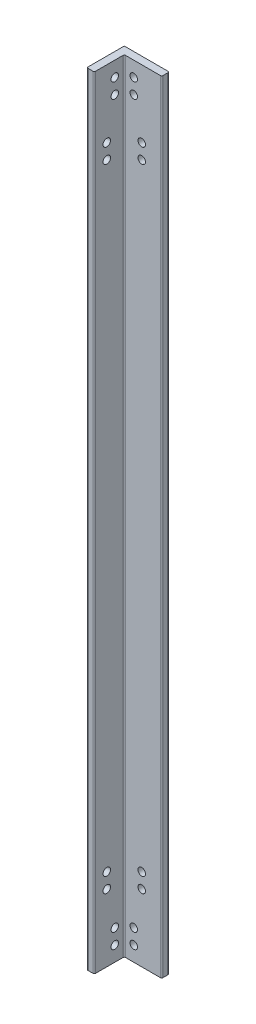
ISO-10303-21;
HEADER;
FILE_DESCRIPTION(('STEP AP214'),'2;1');
FILE_NAME('part.step','',(''),(''),'','','');
FILE_SCHEMA(('AUTOMOTIVE_DESIGN { 1 0 10303 214 1 1 1 1 }'));
ENDSEC;
DATA;
#1=APPLICATION_CONTEXT('core data for automotive mechanical design processes');
#2=APPLICATION_PROTOCOL_DEFINITION('international standard','automotive_design',2000,#1);
#3=PRODUCT_CONTEXT('',#1,'mechanical');
#4=PRODUCT('Part','Part','',(#3));
#5=PRODUCT_RELATED_PRODUCT_CATEGORY('part','',(#4));
#6=PRODUCT_DEFINITION_FORMATION('','',#4);
#7=PRODUCT_DEFINITION_CONTEXT('part definition',#1,'design');
#8=PRODUCT_DEFINITION('design','',#6,#7);
#9=PRODUCT_DEFINITION_SHAPE('','',#8);
#10=(LENGTH_UNIT() NAMED_UNIT(*) SI_UNIT(.MILLI.,.METRE.));
#11=(NAMED_UNIT(*) PLANE_ANGLE_UNIT() SI_UNIT($,.RADIAN.));
#12=(NAMED_UNIT(*) SI_UNIT($,.STERADIAN.) SOLID_ANGLE_UNIT());
#13=UNCERTAINTY_MEASURE_WITH_UNIT(LENGTH_MEASURE(1.E-05),#10,'distance_accuracy_value','');
#14=(GEOMETRIC_REPRESENTATION_CONTEXT(3) GLOBAL_UNCERTAINTY_ASSIGNED_CONTEXT((#13)) GLOBAL_UNIT_ASSIGNED_CONTEXT((#10,
#11,#12)) REPRESENTATION_CONTEXT('',''));
#15=CARTESIAN_POINT('',(0.,0.,0.));
#16=DIRECTION('',(0.,0.,1.));
#17=DIRECTION('',(1.,0.,0.));
#18=AXIS2_PLACEMENT_3D('',#15,#16,#17);
#19=CARTESIAN_POINT('',(0.,-293.642857142857,3.));
#20=DIRECTION('',(0.,-1.,0.));
#21=DIRECTION('',(0.,0.,-1.));
#22=AXIS2_PLACEMENT_3D('',#19,#20,#21);
#23=PLANE('',#22);
#24=DIRECTION('',(-1.,0.,0.));
#25=VECTOR('',#24,1.);
#26=CARTESIAN_POINT('',(0.,-293.642857142857,0.));
#27=LINE('',#26,#25);
#28=CARTESIAN_POINT('',(14.8428571428572,-293.642857142857,0.));
#29=VERTEX_POINT('',#28);
#30=CARTESIAN_POINT('',(-2.65714285714283,-293.642857142857,0.));
#31=VERTEX_POINT('',#30);
#32=EDGE_CURVE('E140',#29,#31,#27,.T.);
#33=ORIENTED_EDGE('',*,*,#32,.F.);
#34=CARTESIAN_POINT('',(14.8428571428572,-293.642857142857,0.5));
#35=DIRECTION('',(0.,-1.,0.));
#36=DIRECTION('',(0.,0.,-1.));
#37=AXIS2_PLACEMENT_3D('',#34,#35,#36);
#38=CIRCLE('',#37,0.5);
#39=CARTESIAN_POINT('',(15.3428571428572,-293.642857142857,0.5));
#40=VERTEX_POINT('',#39);
#41=EDGE_CURVE('E227',#29,#40,#38,.T.);
#42=ORIENTED_EDGE('',*,*,#41,.T.);
#43=DIRECTION('',(0.,0.,-1.));
#44=VECTOR('',#43,1.);
#45=CARTESIAN_POINT('',(15.3428571428572,-293.642857142857,3.));
#46=LINE('',#45,#44);
#47=CARTESIAN_POINT('',(15.3428571428572,-293.642857142857,2.5));
#48=VERTEX_POINT('',#47);
#49=EDGE_CURVE('E216',#48,#40,#46,.T.);
#50=ORIENTED_EDGE('',*,*,#49,.F.);
#51=CARTESIAN_POINT('',(14.8428571428572,-293.642857142857,2.5));
#52=DIRECTION('',(0.,-1.,0.));
#53=DIRECTION('',(0.,0.,-1.));
#54=AXIS2_PLACEMENT_3D('',#51,#52,#53);
#55=CIRCLE('',#54,0.5);
#56=CARTESIAN_POINT('',(14.8428571428572,-293.642857142857,3.));
#57=VERTEX_POINT('',#56);
#58=EDGE_CURVE('E225',#48,#57,#55,.T.);
#59=ORIENTED_EDGE('',*,*,#58,.T.);
#60=DIRECTION('',(-1.,0.,0.));
#61=VECTOR('',#60,1.);
#62=CARTESIAN_POINT('',(0.,-293.642857142857,3.));
#63=LINE('',#62,#61);
#64=CARTESIAN_POINT('',(0.842857142857173,-293.642857142857,3.));
#65=VERTEX_POINT('',#64);
#66=EDGE_CURVE('E185',#57,#65,#63,.T.);
#67=ORIENTED_EDGE('',*,*,#66,.T.);
#68=CARTESIAN_POINT('',(0.842857142857173,-293.642857142857,3.5));
#69=DIRECTION('',(0.,-1.,0.));
#70=DIRECTION('',(0.,0.,-1.));
#71=AXIS2_PLACEMENT_3D('',#68,#69,#70);
#72=CIRCLE('',#71,0.5);
#73=CARTESIAN_POINT('',(0.342857142857173,-293.642857142857,3.5));
#74=VERTEX_POINT('',#73);
#75=EDGE_CURVE('E11',#65,#74,#72,.F.);
#76=ORIENTED_EDGE('',*,*,#75,.T.);
#77=DIRECTION('',(0.,0.,-1.));
#78=VECTOR('',#77,1.);
#79=CARTESIAN_POINT('',(0.342857142857173,-293.642857142857,15.));
#80=LINE('',#79,#78);
#81=CARTESIAN_POINT('',(0.342857142857173,-293.642857142857,14.5));
#82=VERTEX_POINT('',#81);
#83=EDGE_CURVE('E156',#82,#74,#80,.T.);
#84=ORIENTED_EDGE('',*,*,#83,.F.);
#85=CARTESIAN_POINT('',(-0.157142857142827,-293.642857142857,14.5));
#86=DIRECTION('',(0.,-1.,0.));
#87=DIRECTION('',(0.,0.,-1.));
#88=AXIS2_PLACEMENT_3D('',#85,#86,#87);
#89=CIRCLE('',#88,0.5);
#90=CARTESIAN_POINT('',(-0.157142857142827,-293.642857142857,15.));
#91=VERTEX_POINT('',#90);
#92=EDGE_CURVE('E221',#82,#91,#89,.T.);
#93=ORIENTED_EDGE('',*,*,#92,.T.);
#94=DIRECTION('',(1.,0.,0.));
#95=VECTOR('',#94,1.);
#96=CARTESIAN_POINT('',(0.,-293.642857142857,15.));
#97=LINE('',#96,#95);
#98=CARTESIAN_POINT('',(-2.15714285714283,-293.642857142857,15.));
#99=VERTEX_POINT('',#98);
#100=EDGE_CURVE('E149',#99,#91,#97,.T.);
#101=ORIENTED_EDGE('',*,*,#100,.F.);
#102=CARTESIAN_POINT('',(-2.15714285714283,-293.642857142857,14.5));
#103=DIRECTION('',(0.,-1.,0.));
#104=DIRECTION('',(0.,0.,-1.));
#105=AXIS2_PLACEMENT_3D('',#102,#103,#104);
#106=CIRCLE('',#105,0.5);
#107=CARTESIAN_POINT('',(-2.65714285714283,-293.642857142857,14.5));
#108=VERTEX_POINT('',#107);
#109=EDGE_CURVE('E223',#99,#108,#106,.T.);
#110=ORIENTED_EDGE('',*,*,#109,.T.);
#111=DIRECTION('',(0.,0.,-1.));
#112=VECTOR('',#111,1.);
#113=CARTESIAN_POINT('',(-2.65714285714283,-293.642857142857,15.));
#114=LINE('',#113,#112);
#115=EDGE_CURVE('E128',#108,#31,#114,.T.);
#116=ORIENTED_EDGE('',*,*,#115,.T.);
#117=EDGE_LOOP('',(#33,#42,#50,#59,#67,#76,#84,#93,#101,#110,#116));
#118=FACE_BOUND('',#117,.T.);
#119=ADVANCED_FACE('F36',(#118),#23,.T.);
#120=CARTESIAN_POINT('',(15.3428571428571,0.,3.));
#121=DIRECTION('',(1.,0.,0.));
#122=DIRECTION('',(0.,1.,0.));
#123=AXIS2_PLACEMENT_3D('',#120,#121,#122);
#124=PLANE('',#123);
#125=ORIENTED_EDGE('',*,*,#49,.T.);
#126=DIRECTION('',(0.,-1.,0.));
#127=VECTOR('',#126,1.);
#128=CARTESIAN_POINT('',(15.3428571428571,19.3571428571429,0.5));
#129=LINE('',#128,#127);
#130=CARTESIAN_POINT('',(15.3428571428571,19.3571428571429,0.5));
#131=VERTEX_POINT('',#130);
#132=EDGE_CURVE('E232',#40,#131,#129,.F.);
#133=ORIENTED_EDGE('',*,*,#132,.T.);
#134=DIRECTION('',(0.,0.,-1.));
#135=VECTOR('',#134,1.);
#136=CARTESIAN_POINT('',(15.3428571428571,19.3571428571429,3.));
#137=LINE('',#136,#135);
#138=CARTESIAN_POINT('',(15.3428571428571,19.3571428571429,2.5));
#139=VERTEX_POINT('',#138);
#140=EDGE_CURVE('E190',#139,#131,#137,.T.);
#141=ORIENTED_EDGE('',*,*,#140,.F.);
#142=DIRECTION('',(0.,-1.,0.));
#143=VECTOR('',#142,1.);
#144=CARTESIAN_POINT('',(15.3428571428571,0.,2.5));
#145=LINE('',#144,#143);
#146=EDGE_CURVE('E229',#139,#48,#145,.T.);
#147=ORIENTED_EDGE('',*,*,#146,.T.);
#148=EDGE_LOOP('',(#125,#133,#141,#147));
#149=FACE_BOUND('',#148,.T.);
#150=ADVANCED_FACE('F279',(#149),#124,.T.);
#151=CARTESIAN_POINT('',(0.,19.3571428571429,3.));
#152=DIRECTION('',(0.,1.,0.));
#153=DIRECTION('',(0.,0.,1.));
#154=AXIS2_PLACEMENT_3D('',#151,#152,#153);
#155=PLANE('',#154);
#156=ORIENTED_EDGE('',*,*,#140,.T.);
#157=CARTESIAN_POINT('',(14.8428571428571,19.3571428571429,0.5));
#158=DIRECTION('',(0.,1.,0.));
#159=DIRECTION('',(0.,0.,1.));
#160=AXIS2_PLACEMENT_3D('',#157,#158,#159);
#161=CIRCLE('',#160,0.5);
#162=CARTESIAN_POINT('',(14.8428571428571,19.3571428571429,0.));
#163=VERTEX_POINT('',#162);
#164=EDGE_CURVE('E135',#131,#163,#161,.T.);
#165=ORIENTED_EDGE('',*,*,#164,.T.);
#166=DIRECTION('',(1.,0.,0.));
#167=VECTOR('',#166,1.);
#168=CARTESIAN_POINT('',(0.,19.3571428571429,0.));
#169=LINE('',#168,#167);
#170=CARTESIAN_POINT('',(-2.6571428571429,19.3571428571429,0.));
#171=VERTEX_POINT('',#170);
#172=EDGE_CURVE('E131',#171,#163,#169,.T.);
#173=ORIENTED_EDGE('',*,*,#172,.F.);
#174=DIRECTION('',(0.,0.,-1.));
#175=VECTOR('',#174,1.);
#176=CARTESIAN_POINT('',(-2.6571428571429,19.3571428571429,15.));
#177=LINE('',#176,#175);
#178=CARTESIAN_POINT('',(-2.6571428571429,19.3571428571429,14.5));
#179=VERTEX_POINT('',#178);
#180=EDGE_CURVE('E118',#179,#171,#177,.T.);
#181=ORIENTED_EDGE('',*,*,#180,.F.);
#182=CARTESIAN_POINT('',(-2.1571428571429,19.3571428571429,14.5));
#183=DIRECTION('',(0.,1.,0.));
#184=DIRECTION('',(0.,0.,1.));
#185=AXIS2_PLACEMENT_3D('',#182,#183,#184);
#186=CIRCLE('',#185,0.5);
#187=CARTESIAN_POINT('',(-2.1571428571429,19.3571428571429,15.));
#188=VERTEX_POINT('',#187);
#189=EDGE_CURVE('E236',#179,#188,#186,.T.);
#190=ORIENTED_EDGE('',*,*,#189,.T.);
#191=DIRECTION('',(-1.,0.,0.));
#192=VECTOR('',#191,1.);
#193=CARTESIAN_POINT('',(0.,19.3571428571429,15.));
#194=LINE('',#193,#192);
#195=CARTESIAN_POINT('',(-0.157142857142903,19.3571428571429,15.));
#196=VERTEX_POINT('',#195);
#197=EDGE_CURVE('E145',#196,#188,#194,.T.);
#198=ORIENTED_EDGE('',*,*,#197,.F.);
#199=CARTESIAN_POINT('',(-0.157142857142903,19.3571428571429,14.5));
#200=DIRECTION('',(0.,1.,0.));
#201=DIRECTION('',(0.,0.,1.));
#202=AXIS2_PLACEMENT_3D('',#199,#200,#201);
#203=CIRCLE('',#202,0.5);
#204=CARTESIAN_POINT('',(0.342857142857097,19.3571428571429,14.5));
#205=VERTEX_POINT('',#204);
#206=EDGE_CURVE('E234',#196,#205,#203,.T.);
#207=ORIENTED_EDGE('',*,*,#206,.T.);
#208=DIRECTION('',(0.,0.,-1.));
#209=VECTOR('',#208,1.);
#210=CARTESIAN_POINT('',(0.342857142857097,19.3571428571429,15.));
#211=LINE('',#210,#209);
#212=CARTESIAN_POINT('',(0.342857142857097,19.3571428571429,3.5));
#213=VERTEX_POINT('',#212);
#214=EDGE_CURVE('E127',#205,#213,#211,.T.);
#215=ORIENTED_EDGE('',*,*,#214,.T.);
#216=CARTESIAN_POINT('',(0.842857142857097,19.3571428571429,3.5));
#217=DIRECTION('',(0.,1.,0.));
#218=DIRECTION('',(0.,0.,1.));
#219=AXIS2_PLACEMENT_3D('',#216,#217,#218);
#220=CIRCLE('',#219,0.5);
#221=CARTESIAN_POINT('',(0.842857142857097,19.3571428571429,3.));
#222=VERTEX_POINT('',#221);
#223=EDGE_CURVE('E44',#213,#222,#220,.F.);
#224=ORIENTED_EDGE('',*,*,#223,.T.);
#225=DIRECTION('',(1.,0.,0.));
#226=VECTOR('',#225,1.);
#227=CARTESIAN_POINT('',(0.,19.3571428571429,3.));
#228=LINE('',#227,#226);
#229=CARTESIAN_POINT('',(14.8428571428571,19.3571428571429,3.));
#230=VERTEX_POINT('',#229);
#231=EDGE_CURVE('E188',#222,#230,#228,.T.);
#232=ORIENTED_EDGE('',*,*,#231,.T.);
#233=CARTESIAN_POINT('',(14.8428571428571,19.3571428571429,2.5));
#234=DIRECTION('',(0.,1.,0.));
#235=DIRECTION('',(0.,0.,1.));
#236=AXIS2_PLACEMENT_3D('',#233,#234,#235);
#237=CIRCLE('',#236,0.5);
#238=EDGE_CURVE('E238',#230,#139,#237,.T.);
#239=ORIENTED_EDGE('',*,*,#238,.T.);
#240=EDGE_LOOP('',(#156,#165,#173,#181,#190,#198,#207,#215,#224,#232,#239));
#241=FACE_BOUND('',#240,.T.);
#242=ADVANCED_FACE('F133',(#241),#155,.T.);
#243=CARTESIAN_POINT('',(4.1428571428571,13.3571428571429,3.));
#244=DIRECTION('',(0.,0.,-1.));
#245=DIRECTION('',(-1.,0.,0.));
#246=AXIS2_PLACEMENT_3D('',#243,#244,#245);
#247=CYLINDRICAL_SURFACE('',#246,1.5);
#248=CARTESIAN_POINT('',(4.1428571428571,13.3571428571429,3.));
#249=DIRECTION('',(0.,0.,1.));
#250=DIRECTION('',(1.,0.,0.));
#251=AXIS2_PLACEMENT_3D('',#248,#249,#250);
#252=CIRCLE('',#251,1.5);
#253=CARTESIAN_POINT('',(5.6428571428571,13.3571428571429,3.));
#254=VERTEX_POINT('',#253);
#255=EDGE_CURVE('E182',#254,#254,#252,.T.);
#256=ORIENTED_EDGE('',*,*,#255,.T.);
#257=EDGE_LOOP('',(#256));
#258=FACE_BOUND('',#257,.T.);
#259=CARTESIAN_POINT('',(4.1428571428571,13.3571428571429,0.));
#260=DIRECTION('',(0.,0.,1.));
#261=DIRECTION('',(1.,0.,0.));
#262=AXIS2_PLACEMENT_3D('',#259,#260,#261);
#263=CIRCLE('',#262,1.5);
#264=CARTESIAN_POINT('',(5.6428571428571,13.3571428571429,0.));
#265=VERTEX_POINT('',#264);
#266=EDGE_CURVE('E211',#265,#265,#263,.T.);
#267=ORIENTED_EDGE('',*,*,#266,.F.);
#268=EDGE_LOOP('',(#267));
#269=FACE_BOUND('',#268,.T.);
#270=ADVANCED_FACE('F305',(#258,#269),#247,.F.);
#271=CARTESIAN_POINT('',(4.14285714285713,-287.642857142857,3.));
#272=DIRECTION('',(0.,0.,-1.));
#273=DIRECTION('',(-1.,0.,0.));
#274=AXIS2_PLACEMENT_3D('',#271,#272,#273);
#275=CYLINDRICAL_SURFACE('',#274,1.5);
#276=CARTESIAN_POINT('',(4.14285714285713,-287.642857142857,3.));
#277=DIRECTION('',(0.,0.,1.));
#278=DIRECTION('',(1.,0.,0.));
#279=AXIS2_PLACEMENT_3D('',#276,#277,#278);
#280=CIRCLE('',#279,1.5);
#281=CARTESIAN_POINT('',(5.64285714285714,-287.642857142857,3.));
#282=VERTEX_POINT('',#281);
#283=EDGE_CURVE('E179',#282,#282,#280,.T.);
#284=ORIENTED_EDGE('',*,*,#283,.T.);
#285=EDGE_LOOP('',(#284));
#286=FACE_BOUND('',#285,.T.);
#287=CARTESIAN_POINT('',(4.14285714285713,-287.642857142857,0.));
#288=DIRECTION('',(0.,0.,1.));
#289=DIRECTION('',(1.,0.,0.));
#290=AXIS2_PLACEMENT_3D('',#287,#288,#289);
#291=CIRCLE('',#290,1.5);
#292=CARTESIAN_POINT('',(5.64285714285714,-287.642857142857,0.));
#293=VERTEX_POINT('',#292);
#294=EDGE_CURVE('E208',#293,#293,#291,.T.);
#295=ORIENTED_EDGE('',*,*,#294,.F.);
#296=EDGE_LOOP('',(#295));
#297=FACE_BOUND('',#296,.T.);
#298=ADVANCED_FACE('F308',(#286,#297),#275,.F.);
#299=CARTESIAN_POINT('',(4.1428571428571,7.35714285714287,3.));
#300=DIRECTION('',(0.,0.,-1.));
#301=DIRECTION('',(-1.,0.,0.));
#302=AXIS2_PLACEMENT_3D('',#299,#300,#301);
#303=CYLINDRICAL_SURFACE('',#302,1.5);
#304=CARTESIAN_POINT('',(4.1428571428571,7.35714285714287,3.));
#305=DIRECTION('',(0.,0.,1.));
#306=DIRECTION('',(1.,0.,0.));
#307=AXIS2_PLACEMENT_3D('',#304,#305,#306);
#308=CIRCLE('',#307,1.5);
#309=CARTESIAN_POINT('',(5.6428571428571,7.35714285714287,3.));
#310=VERTEX_POINT('',#309);
#311=EDGE_CURVE('E176',#310,#310,#308,.T.);
#312=ORIENTED_EDGE('',*,*,#311,.T.);
#313=EDGE_LOOP('',(#312));
#314=FACE_BOUND('',#313,.T.);
#315=CARTESIAN_POINT('',(4.1428571428571,7.35714285714287,0.));
#316=DIRECTION('',(0.,0.,1.));
#317=DIRECTION('',(1.,0.,0.));
#318=AXIS2_PLACEMENT_3D('',#315,#316,#317);
#319=CIRCLE('',#318,1.5);
#320=CARTESIAN_POINT('',(5.6428571428571,7.35714285714287,0.));
#321=VERTEX_POINT('',#320);
#322=EDGE_CURVE('E205',#321,#321,#319,.T.);
#323=ORIENTED_EDGE('',*,*,#322,.F.);
#324=EDGE_LOOP('',(#323));
#325=FACE_BOUND('',#324,.T.);
#326=ADVANCED_FACE('F312',(#314,#325),#303,.F.);
#327=CARTESIAN_POINT('',(4.14285714285713,-281.642857142857,3.));
#328=DIRECTION('',(0.,0.,-1.));
#329=DIRECTION('',(-1.,0.,0.));
#330=AXIS2_PLACEMENT_3D('',#327,#328,#329);
#331=CYLINDRICAL_SURFACE('',#330,1.5);
#332=CARTESIAN_POINT('',(4.14285714285713,-281.642857142857,3.));
#333=DIRECTION('',(0.,0.,1.));
#334=DIRECTION('',(1.,0.,0.));
#335=AXIS2_PLACEMENT_3D('',#332,#333,#334);
#336=CIRCLE('',#335,1.5);
#337=CARTESIAN_POINT('',(5.64285714285714,-281.642857142857,3.));
#338=VERTEX_POINT('',#337);
#339=EDGE_CURVE('E173',#338,#338,#336,.T.);
#340=ORIENTED_EDGE('',*,*,#339,.T.);
#341=EDGE_LOOP('',(#340));
#342=FACE_BOUND('',#341,.T.);
#343=CARTESIAN_POINT('',(4.14285714285713,-281.642857142857,0.));
#344=DIRECTION('',(0.,0.,1.));
#345=DIRECTION('',(1.,0.,0.));
#346=AXIS2_PLACEMENT_3D('',#343,#344,#345);
#347=CIRCLE('',#346,1.5);
#348=CARTESIAN_POINT('',(5.64285714285714,-281.642857142857,0.));
#349=VERTEX_POINT('',#348);
#350=EDGE_CURVE('E202',#349,#349,#347,.T.);
#351=ORIENTED_EDGE('',*,*,#350,.F.);
#352=EDGE_LOOP('',(#351));
#353=FACE_BOUND('',#352,.T.);
#354=ADVANCED_FACE('F316',(#342,#353),#331,.F.);
#355=CARTESIAN_POINT('',(7.34285714285717,-266.642857142857,3.));
#356=DIRECTION('',(0.,0.,-1.));
#357=DIRECTION('',(-1.,0.,0.));
#358=AXIS2_PLACEMENT_3D('',#355,#356,#357);
#359=CYLINDRICAL_SURFACE('',#358,1.5);
#360=CARTESIAN_POINT('',(7.34285714285717,-266.642857142857,3.));
#361=DIRECTION('',(0.,0.,1.));
#362=DIRECTION('',(1.,0.,0.));
#363=AXIS2_PLACEMENT_3D('',#360,#361,#362);
#364=CIRCLE('',#363,1.5);
#365=CARTESIAN_POINT('',(8.84285714285717,-266.642857142857,3.));
#366=VERTEX_POINT('',#365);
#367=EDGE_CURVE('E170',#366,#366,#364,.T.);
#368=ORIENTED_EDGE('',*,*,#367,.T.);
#369=EDGE_LOOP('',(#368));
#370=FACE_BOUND('',#369,.T.);
#371=CARTESIAN_POINT('',(7.34285714285717,-266.642857142857,0.));
#372=DIRECTION('',(0.,0.,1.));
#373=DIRECTION('',(1.,0.,0.));
#374=AXIS2_PLACEMENT_3D('',#371,#372,#373);
#375=CIRCLE('',#374,1.5);
#376=CARTESIAN_POINT('',(8.84285714285717,-266.642857142857,0.));
#377=VERTEX_POINT('',#376);
#378=EDGE_CURVE('E199',#377,#377,#375,.T.);
#379=ORIENTED_EDGE('',*,*,#378,.F.);
#380=EDGE_LOOP('',(#379));
#381=FACE_BOUND('',#380,.T.);
#382=ADVANCED_FACE('F320',(#370,#381),#359,.F.);
#383=CARTESIAN_POINT('',(7.34285714285717,-260.642857142857,3.));
#384=DIRECTION('',(0.,0.,-1.));
#385=DIRECTION('',(-1.,0.,0.));
#386=AXIS2_PLACEMENT_3D('',#383,#384,#385);
#387=CYLINDRICAL_SURFACE('',#386,1.5);
#388=CARTESIAN_POINT('',(7.34285714285717,-260.642857142857,3.));
#389=DIRECTION('',(0.,0.,1.));
#390=DIRECTION('',(1.,0.,0.));
#391=AXIS2_PLACEMENT_3D('',#388,#389,#390);
#392=CIRCLE('',#391,1.5);
#393=CARTESIAN_POINT('',(8.84285714285718,-260.642857142857,3.));
#394=VERTEX_POINT('',#393);
#395=EDGE_CURVE('E167',#394,#394,#392,.T.);
#396=ORIENTED_EDGE('',*,*,#395,.T.);
#397=EDGE_LOOP('',(#396));
#398=FACE_BOUND('',#397,.T.);
#399=CARTESIAN_POINT('',(7.34285714285717,-260.642857142857,0.));
#400=DIRECTION('',(0.,0.,1.));
#401=DIRECTION('',(1.,0.,0.));
#402=AXIS2_PLACEMENT_3D('',#399,#400,#401);
#403=CIRCLE('',#402,1.5);
#404=CARTESIAN_POINT('',(8.84285714285718,-260.642857142857,0.));
#405=VERTEX_POINT('',#404);
#406=EDGE_CURVE('E196',#405,#405,#403,.T.);
#407=ORIENTED_EDGE('',*,*,#406,.F.);
#408=EDGE_LOOP('',(#407));
#409=FACE_BOUND('',#408,.T.);
#410=ADVANCED_FACE('F324',(#398,#409),#387,.F.);
#411=CARTESIAN_POINT('',(7.34285714285717,-13.6428571428571,3.));
#412=DIRECTION('',(0.,0.,-1.));
#413=DIRECTION('',(-1.,0.,0.));
#414=AXIS2_PLACEMENT_3D('',#411,#412,#413);
#415=CYLINDRICAL_SURFACE('',#414,1.5);
#416=CARTESIAN_POINT('',(7.34285714285717,-13.6428571428571,3.));
#417=DIRECTION('',(0.,0.,1.));
#418=DIRECTION('',(1.,0.,0.));
#419=AXIS2_PLACEMENT_3D('',#416,#417,#418);
#420=CIRCLE('',#419,1.5);
#421=CARTESIAN_POINT('',(8.84285714285717,-13.6428571428571,3.));
#422=VERTEX_POINT('',#421);
#423=EDGE_CURVE('E164',#422,#422,#420,.T.);
#424=ORIENTED_EDGE('',*,*,#423,.T.);
#425=EDGE_LOOP('',(#424));
#426=FACE_BOUND('',#425,.T.);
#427=CARTESIAN_POINT('',(7.34285714285717,-13.6428571428571,0.));
#428=DIRECTION('',(0.,0.,1.));
#429=DIRECTION('',(1.,0.,0.));
#430=AXIS2_PLACEMENT_3D('',#427,#428,#429);
#431=CIRCLE('',#430,1.5);
#432=CARTESIAN_POINT('',(8.84285714285717,-13.6428571428571,0.));
#433=VERTEX_POINT('',#432);
#434=EDGE_CURVE('E193',#433,#433,#431,.T.);
#435=ORIENTED_EDGE('',*,*,#434,.F.);
#436=EDGE_LOOP('',(#435));
#437=FACE_BOUND('',#436,.T.);
#438=ADVANCED_FACE('F328',(#426,#437),#415,.F.);
#439=CARTESIAN_POINT('',(7.34285714285717,-7.64285714285712,3.));
#440=DIRECTION('',(0.,0.,-1.));
#441=DIRECTION('',(-1.,0.,0.));
#442=AXIS2_PLACEMENT_3D('',#439,#440,#441);
#443=CYLINDRICAL_SURFACE('',#442,1.5);
#444=CARTESIAN_POINT('',(7.34285714285717,-7.64285714285712,3.));
#445=DIRECTION('',(0.,0.,1.));
#446=DIRECTION('',(1.,0.,0.));
#447=AXIS2_PLACEMENT_3D('',#444,#445,#446);
#448=CIRCLE('',#447,1.5);
#449=CARTESIAN_POINT('',(8.84285714285717,-7.64285714285712,3.));
#450=VERTEX_POINT('',#449);
#451=EDGE_CURVE('E139',#450,#450,#448,.T.);
#452=ORIENTED_EDGE('',*,*,#451,.T.);
#453=EDGE_LOOP('',(#452));
#454=FACE_BOUND('',#453,.T.);
#455=CARTESIAN_POINT('',(7.34285714285717,-7.64285714285712,0.));
#456=DIRECTION('',(0.,0.,1.));
#457=DIRECTION('',(1.,0.,0.));
#458=AXIS2_PLACEMENT_3D('',#455,#456,#457);
#459=CIRCLE('',#458,1.5);
#460=CARTESIAN_POINT('',(8.84285714285717,-7.64285714285712,0.));
#461=VERTEX_POINT('',#460);
#462=EDGE_CURVE('E161',#461,#461,#459,.T.);
#463=ORIENTED_EDGE('',*,*,#462,.F.);
#464=EDGE_LOOP('',(#463));
#465=FACE_BOUND('',#464,.T.);
#466=ADVANCED_FACE('F331',(#454,#465),#443,.F.);
#467=CARTESIAN_POINT('',(0.,0.,3.));
#468=DIRECTION('',(0.,0.,1.));
#469=DIRECTION('',(1.,0.,0.));
#470=AXIS2_PLACEMENT_3D('',#467,#468,#469);
#471=PLANE('',#470);
#472=ORIENTED_EDGE('',*,*,#451,.F.);
#473=EDGE_LOOP('',(#472));
#474=FACE_BOUND('',#473,.T.);
#475=ORIENTED_EDGE('',*,*,#423,.F.);
#476=EDGE_LOOP('',(#475));
#477=FACE_BOUND('',#476,.T.);
#478=ORIENTED_EDGE('',*,*,#395,.F.);
#479=EDGE_LOOP('',(#478));
#480=FACE_BOUND('',#479,.T.);
#481=ORIENTED_EDGE('',*,*,#367,.F.);
#482=EDGE_LOOP('',(#481));
#483=FACE_BOUND('',#482,.T.);
#484=ORIENTED_EDGE('',*,*,#339,.F.);
#485=EDGE_LOOP('',(#484));
#486=FACE_BOUND('',#485,.T.);
#487=ORIENTED_EDGE('',*,*,#311,.F.);
#488=EDGE_LOOP('',(#487));
#489=FACE_BOUND('',#488,.T.);
#490=ORIENTED_EDGE('',*,*,#283,.F.);
#491=EDGE_LOOP('',(#490));
#492=FACE_BOUND('',#491,.T.);
#493=ORIENTED_EDGE('',*,*,#255,.F.);
#494=EDGE_LOOP('',(#493));
#495=FACE_BOUND('',#494,.T.);
#496=ORIENTED_EDGE('',*,*,#66,.F.);
#497=DIRECTION('',(0.,-1.,0.));
#498=VECTOR('',#497,1.);
#499=CARTESIAN_POINT('',(14.8428571428571,0.,3.));
#500=LINE('',#499,#498);
#501=EDGE_CURVE('E51',#57,#230,#500,.F.);
#502=ORIENTED_EDGE('',*,*,#501,.T.);
#503=ORIENTED_EDGE('',*,*,#231,.F.);
#504=DIRECTION('',(0.,1.,0.));
#505=VECTOR('',#504,1.);
#506=CARTESIAN_POINT('',(0.842857142857101,0.,3.));
#507=LINE('',#506,#505);
#508=EDGE_CURVE('E241',#222,#65,#507,.F.);
#509=ORIENTED_EDGE('',*,*,#508,.T.);
#510=EDGE_LOOP('',(#496,#502,#503,#509));
#511=FACE_BOUND('',#510,.T.);
#512=ADVANCED_FACE('F334',(#474,#477,#480,#483,#486,#489,#492,#495,#511),#471,.T.);
#513=CARTESIAN_POINT('',(0.,0.,0.));
#514=DIRECTION('',(0.,0.,1.));
#515=DIRECTION('',(1.,0.,0.));
#516=AXIS2_PLACEMENT_3D('',#513,#514,#515);
#517=PLANE('',#516);
#518=ORIENTED_EDGE('',*,*,#462,.T.);
#519=EDGE_LOOP('',(#518));
#520=FACE_BOUND('',#519,.T.);
#521=ORIENTED_EDGE('',*,*,#434,.T.);
#522=EDGE_LOOP('',(#521));
#523=FACE_BOUND('',#522,.T.);
#524=ORIENTED_EDGE('',*,*,#406,.T.);
#525=EDGE_LOOP('',(#524));
#526=FACE_BOUND('',#525,.T.);
#527=ORIENTED_EDGE('',*,*,#378,.T.);
#528=EDGE_LOOP('',(#527));
#529=FACE_BOUND('',#528,.T.);
#530=ORIENTED_EDGE('',*,*,#350,.T.);
#531=EDGE_LOOP('',(#530));
#532=FACE_BOUND('',#531,.T.);
#533=ORIENTED_EDGE('',*,*,#322,.T.);
#534=EDGE_LOOP('',(#533));
#535=FACE_BOUND('',#534,.T.);
#536=ORIENTED_EDGE('',*,*,#294,.T.);
#537=EDGE_LOOP('',(#536));
#538=FACE_BOUND('',#537,.T.);
#539=ORIENTED_EDGE('',*,*,#266,.T.);
#540=EDGE_LOOP('',(#539));
#541=FACE_BOUND('',#540,.T.);
#542=ORIENTED_EDGE('',*,*,#172,.T.);
#543=DIRECTION('',(0.,-1.,0.));
#544=VECTOR('',#543,1.);
#545=CARTESIAN_POINT('',(14.8428571428572,-293.642857142857,0.));
#546=LINE('',#545,#544);
#547=EDGE_CURVE('E219',#163,#29,#546,.T.);
#548=ORIENTED_EDGE('',*,*,#547,.T.);
#549=ORIENTED_EDGE('',*,*,#32,.T.);
#550=DIRECTION('',(0.,-1.,0.));
#551=VECTOR('',#550,1.);
#552=CARTESIAN_POINT('',(-2.6571428571429,0.,0.));
#553=LINE('',#552,#551);
#554=EDGE_CURVE('E123',#171,#31,#553,.T.);
#555=ORIENTED_EDGE('',*,*,#554,.F.);
#556=EDGE_LOOP('',(#542,#548,#549,#555));
#557=FACE_BOUND('',#556,.T.);
#558=ADVANCED_FACE('F143',(#520,#523,#526,#529,#532,#535,#538,#541,#557),#517,.F.);
#559=CARTESIAN_POINT('',(0.342857142857101,0.,15.));
#560=DIRECTION('',(-1.,0.,0.));
#561=DIRECTION('',(0.,-1.,0.));
#562=AXIS2_PLACEMENT_3D('',#559,#560,#561);
#563=PLANE('',#562);
#564=CARTESIAN_POINT('',(0.342857142857098,13.3571428571429,6.8));
#565=DIRECTION('',(-1.,0.,0.));
#566=DIRECTION('',(0.,-1.,0.));
#567=AXIS2_PLACEMENT_3D('',#564,#565,#566);
#568=CIRCLE('',#567,1.5);
#569=CARTESIAN_POINT('',(0.342857142857098,11.8571428571429,6.8));
#570=VERTEX_POINT('',#569);
#571=EDGE_CURVE('E146',#570,#570,#568,.F.);
#572=ORIENTED_EDGE('',*,*,#571,.F.);
#573=EDGE_LOOP('',(#572));
#574=FACE_BOUND('',#573,.T.);
#575=CARTESIAN_POINT('',(0.342857142857103,-7.64285714285712,10.));
#576=DIRECTION('',(-1.,0.,0.));
#577=DIRECTION('',(0.,-1.,0.));
#578=AXIS2_PLACEMENT_3D('',#575,#576,#577);
#579=CIRCLE('',#578,1.5);
#580=CARTESIAN_POINT('',(0.342857142857104,-9.14285714285712,10.));
#581=VERTEX_POINT('',#580);
#582=EDGE_CURVE('E643',#581,#581,#579,.F.);
#583=ORIENTED_EDGE('',*,*,#582,.F.);
#584=EDGE_LOOP('',(#583));
#585=FACE_BOUND('',#584,.T.);
#586=CARTESIAN_POINT('',(0.342857142857105,-13.6428571428571,10.));
#587=DIRECTION('',(-1.,0.,0.));
#588=DIRECTION('',(0.,-1.,0.));
#589=AXIS2_PLACEMENT_3D('',#586,#587,#588);
#590=CIRCLE('',#589,1.5);
#591=CARTESIAN_POINT('',(0.342857142857105,-15.1428571428571,10.));
#592=VERTEX_POINT('',#591);
#593=EDGE_CURVE('E650',#592,#592,#590,.F.);
#594=ORIENTED_EDGE('',*,*,#593,.F.);
#595=EDGE_LOOP('',(#594));
#596=FACE_BOUND('',#595,.T.);
#597=CARTESIAN_POINT('',(0.342857142857164,-260.642857142857,10.));
#598=DIRECTION('',(-1.,0.,0.));
#599=DIRECTION('',(0.,-1.,0.));
#600=AXIS2_PLACEMENT_3D('',#597,#598,#599);
#601=CIRCLE('',#600,1.5);
#602=CARTESIAN_POINT('',(0.342857142857164,-262.142857142857,10.));
#603=VERTEX_POINT('',#602);
#604=EDGE_CURVE('E620',#603,#603,#601,.F.);
#605=ORIENTED_EDGE('',*,*,#604,.F.);
#606=EDGE_LOOP('',(#605));
#607=FACE_BOUND('',#606,.T.);
#608=CARTESIAN_POINT('',(0.342857142857171,-287.642857142857,6.8));
#609=DIRECTION('',(-1.,0.,0.));
#610=DIRECTION('',(0.,-1.,0.));
#611=AXIS2_PLACEMENT_3D('',#608,#609,#610);
#612=CIRCLE('',#611,1.5);
#613=CARTESIAN_POINT('',(0.342857142857171,-289.142857142857,6.8));
#614=VERTEX_POINT('',#613);
#615=EDGE_CURVE('E627',#614,#614,#612,.F.);
#616=ORIENTED_EDGE('',*,*,#615,.F.);
#617=EDGE_LOOP('',(#616));
#618=FACE_BOUND('',#617,.T.);
#619=CARTESIAN_POINT('',(0.342857142857166,-266.642857142857,10.));
#620=DIRECTION('',(-1.,0.,0.));
#621=DIRECTION('',(0.,-1.,0.));
#622=AXIS2_PLACEMENT_3D('',#619,#620,#621);
#623=CIRCLE('',#622,1.5);
#624=CARTESIAN_POINT('',(0.342857142857166,-268.142857142857,10.));
#625=VERTEX_POINT('',#624);
#626=EDGE_CURVE('E628',#625,#625,#623,.F.);
#627=ORIENTED_EDGE('',*,*,#626,.F.);
#628=EDGE_LOOP('',(#627));
#629=FACE_BOUND('',#628,.T.);
#630=CARTESIAN_POINT('',(0.342857142857169,-281.642857142857,6.8));
#631=DIRECTION('',(-1.,0.,0.));
#632=DIRECTION('',(0.,-1.,0.));
#633=AXIS2_PLACEMENT_3D('',#630,#631,#632);
#634=CIRCLE('',#633,1.5);
#635=CARTESIAN_POINT('',(0.342857142857169,-283.142857142857,6.8));
#636=VERTEX_POINT('',#635);
#637=EDGE_CURVE('E618',#636,#636,#634,.F.);
#638=ORIENTED_EDGE('',*,*,#637,.F.);
#639=EDGE_LOOP('',(#638));
#640=FACE_BOUND('',#639,.T.);
#641=CARTESIAN_POINT('',(0.3428571428571,7.35714285714288,6.8));
#642=DIRECTION('',(-1.,0.,0.));
#643=DIRECTION('',(0.,-1.,0.));
#644=AXIS2_PLACEMENT_3D('',#641,#642,#643);
#645=CIRCLE('',#644,1.5);
#646=CARTESIAN_POINT('',(0.3428571428571,5.85714285714288,6.8));
#647=VERTEX_POINT('',#646);
#648=EDGE_CURVE('E613',#647,#647,#645,.F.);
#649=ORIENTED_EDGE('',*,*,#648,.F.);
#650=EDGE_LOOP('',(#649));
#651=FACE_BOUND('',#650,.T.);
#652=ORIENTED_EDGE('',*,*,#214,.F.);
#653=DIRECTION('',(0.,1.,0.));
#654=VECTOR('',#653,1.);
#655=CARTESIAN_POINT('',(0.342857142857173,-293.642857142857,14.5));
#656=LINE('',#655,#654);
#657=EDGE_CURVE('E254',#205,#82,#656,.F.);
#658=ORIENTED_EDGE('',*,*,#657,.T.);
#659=ORIENTED_EDGE('',*,*,#83,.T.);
#660=DIRECTION('',(0.,1.,0.));
#661=VECTOR('',#660,1.);
#662=CARTESIAN_POINT('',(0.342857142857101,0.,3.5));
#663=LINE('',#662,#661);
#664=EDGE_CURVE('E251',#74,#213,#663,.T.);
#665=ORIENTED_EDGE('',*,*,#664,.T.);
#666=EDGE_LOOP('',(#652,#658,#659,#665));
#667=FACE_BOUND('',#666,.T.);
#668=ADVANCED_FACE('F259',(#574,#585,#596,#607,#618,#629,#640,#651,#667),#563,.F.);
#669=CARTESIAN_POINT('',(-2.6571428571429,0.,15.));
#670=DIRECTION('',(1.,0.,0.));
#671=DIRECTION('',(0.,1.,0.));
#672=AXIS2_PLACEMENT_3D('',#669,#670,#671);
#673=PLANE('',#672);
#674=CARTESIAN_POINT('',(-2.6571428571429,13.3571428571429,6.8));
#675=DIRECTION('',(-1.,0.,0.));
#676=DIRECTION('',(0.,-1.,0.));
#677=AXIS2_PLACEMENT_3D('',#674,#675,#676);
#678=CIRCLE('',#677,1.5);
#679=CARTESIAN_POINT('',(-2.6571428571429,11.8571428571429,6.8));
#680=VERTEX_POINT('',#679);
#681=EDGE_CURVE('E152',#680,#680,#678,.T.);
#682=ORIENTED_EDGE('',*,*,#681,.F.);
#683=EDGE_LOOP('',(#682));
#684=FACE_BOUND('',#683,.T.);
#685=CARTESIAN_POINT('',(-2.6571428571429,-7.64285714285712,10.));
#686=DIRECTION('',(-1.,0.,0.));
#687=DIRECTION('',(0.,-1.,0.));
#688=AXIS2_PLACEMENT_3D('',#685,#686,#687);
#689=CIRCLE('',#688,1.5);
#690=CARTESIAN_POINT('',(-2.6571428571429,-9.14285714285712,10.));
#691=VERTEX_POINT('',#690);
#692=EDGE_CURVE('E647',#691,#691,#689,.T.);
#693=ORIENTED_EDGE('',*,*,#692,.F.);
#694=EDGE_LOOP('',(#693));
#695=FACE_BOUND('',#694,.T.);
#696=CARTESIAN_POINT('',(-2.6571428571429,-13.6428571428571,10.));
#697=DIRECTION('',(-1.,0.,0.));
#698=DIRECTION('',(0.,-1.,0.));
#699=AXIS2_PLACEMENT_3D('',#696,#697,#698);
#700=CIRCLE('',#699,1.5);
#701=CARTESIAN_POINT('',(-2.6571428571429,-15.1428571428571,10.));
#702=VERTEX_POINT('',#701);
#703=EDGE_CURVE('E646',#702,#702,#700,.T.);
#704=ORIENTED_EDGE('',*,*,#703,.F.);
#705=EDGE_LOOP('',(#704));
#706=FACE_BOUND('',#705,.T.);
#707=CARTESIAN_POINT('',(-2.65714285714287,-260.642857142857,10.));
#708=DIRECTION('',(-1.,0.,0.));
#709=DIRECTION('',(0.,-1.,0.));
#710=AXIS2_PLACEMENT_3D('',#707,#708,#709);
#711=CIRCLE('',#710,1.5);
#712=CARTESIAN_POINT('',(-2.65714285714287,-262.142857142857,10.));
#713=VERTEX_POINT('',#712);
#714=EDGE_CURVE('E653',#713,#713,#711,.T.);
#715=ORIENTED_EDGE('',*,*,#714,.F.);
#716=EDGE_LOOP('',(#715));
#717=FACE_BOUND('',#716,.T.);
#718=CARTESIAN_POINT('',(-2.65714285714287,-287.642857142857,6.8));
#719=DIRECTION('',(-1.,0.,0.));
#720=DIRECTION('',(0.,-1.,0.));
#721=AXIS2_PLACEMENT_3D('',#718,#719,#720);
#722=CIRCLE('',#721,1.5);
#723=CARTESIAN_POINT('',(-2.65714285714287,-289.142857142857,6.8));
#724=VERTEX_POINT('',#723);
#725=EDGE_CURVE('E624',#724,#724,#722,.T.);
#726=ORIENTED_EDGE('',*,*,#725,.F.);
#727=EDGE_LOOP('',(#726));
#728=FACE_BOUND('',#727,.T.);
#729=CARTESIAN_POINT('',(-2.65714285714287,-266.642857142857,10.));
#730=DIRECTION('',(-1.,0.,0.));
#731=DIRECTION('',(0.,-1.,0.));
#732=AXIS2_PLACEMENT_3D('',#729,#730,#731);
#733=CIRCLE('',#732,1.5);
#734=CARTESIAN_POINT('',(-2.65714285714287,-268.142857142857,10.));
#735=VERTEX_POINT('',#734);
#736=EDGE_CURVE('E631',#735,#735,#733,.T.);
#737=ORIENTED_EDGE('',*,*,#736,.F.);
#738=EDGE_LOOP('',(#737));
#739=FACE_BOUND('',#738,.T.);
#740=CARTESIAN_POINT('',(-2.65714285714287,-281.642857142857,6.8));
#741=DIRECTION('',(-1.,0.,0.));
#742=DIRECTION('',(0.,-1.,0.));
#743=AXIS2_PLACEMENT_3D('',#740,#741,#742);
#744=CIRCLE('',#743,1.5);
#745=CARTESIAN_POINT('',(-2.65714285714287,-283.142857142857,6.8));
#746=VERTEX_POINT('',#745);
#747=EDGE_CURVE('E615',#746,#746,#744,.T.);
#748=ORIENTED_EDGE('',*,*,#747,.F.);
#749=EDGE_LOOP('',(#748));
#750=FACE_BOUND('',#749,.T.);
#751=CARTESIAN_POINT('',(-2.6571428571429,7.35714285714288,6.8));
#752=DIRECTION('',(-1.,0.,0.));
#753=DIRECTION('',(0.,-1.,0.));
#754=AXIS2_PLACEMENT_3D('',#751,#752,#753);
#755=CIRCLE('',#754,1.5);
#756=CARTESIAN_POINT('',(-2.6571428571429,5.85714285714288,6.8));
#757=VERTEX_POINT('',#756);
#758=EDGE_CURVE('E610',#757,#757,#755,.T.);
#759=ORIENTED_EDGE('',*,*,#758,.F.);
#760=EDGE_LOOP('',(#759));
#761=FACE_BOUND('',#760,.T.);
#762=ORIENTED_EDGE('',*,*,#115,.F.);
#763=DIRECTION('',(0.,-1.,0.));
#764=VECTOR('',#763,1.);
#765=CARTESIAN_POINT('',(-2.6571428571429,19.3571428571429,14.5));
#766=LINE('',#765,#764);
#767=EDGE_CURVE('E125',#108,#179,#766,.F.);
#768=ORIENTED_EDGE('',*,*,#767,.T.);
#769=ORIENTED_EDGE('',*,*,#180,.T.);
#770=ORIENTED_EDGE('',*,*,#554,.T.);
#771=EDGE_LOOP('',(#762,#768,#769,#770));
#772=FACE_BOUND('',#771,.T.);
#773=ADVANCED_FACE('F121',(#684,#695,#706,#717,#728,#739,#750,#761,#772),#673,.F.);
#774=CARTESIAN_POINT('',(0.,0.,15.));
#775=DIRECTION('',(0.,0.,1.));
#776=DIRECTION('',(1.,0.,0.));
#777=AXIS2_PLACEMENT_3D('',#774,#775,#776);
#778=PLANE('',#777);
#779=ORIENTED_EDGE('',*,*,#197,.T.);
#780=DIRECTION('',(0.,-1.,0.));
#781=VECTOR('',#780,1.);
#782=CARTESIAN_POINT('',(-2.15714285714283,-293.642857142857,15.));
#783=LINE('',#782,#781);
#784=EDGE_CURVE('E247',#188,#99,#783,.T.);
#785=ORIENTED_EDGE('',*,*,#784,.T.);
#786=ORIENTED_EDGE('',*,*,#100,.T.);
#787=DIRECTION('',(0.,1.,0.));
#788=VECTOR('',#787,1.);
#789=CARTESIAN_POINT('',(-0.157142857142903,19.3571428571429,15.));
#790=LINE('',#789,#788);
#791=EDGE_CURVE('E244',#91,#196,#790,.T.);
#792=ORIENTED_EDGE('',*,*,#791,.T.);
#793=EDGE_LOOP('',(#779,#785,#786,#792));
#794=FACE_BOUND('',#793,.T.);
#795=ADVANCED_FACE('F271',(#794),#778,.T.);
#796=CARTESIAN_POINT('',(15.3438571428572,7.35714285714288,6.8));
#797=DIRECTION('',(-1.,0.,0.));
#798=DIRECTION('',(0.,-1.,0.));
#799=AXIS2_PLACEMENT_3D('',#796,#797,#798);
#800=CYLINDRICAL_SURFACE('',#799,1.5);
#801=ORIENTED_EDGE('',*,*,#758,.T.);
#802=EDGE_LOOP('',(#801));
#803=FACE_BOUND('',#802,.T.);
#804=ORIENTED_EDGE('',*,*,#648,.T.);
#805=EDGE_LOOP('',(#804));
#806=FACE_BOUND('',#805,.T.);
#807=ADVANCED_FACE('F503',(#803,#806),#800,.F.);
#808=CARTESIAN_POINT('',(15.3438571428572,-281.642857142857,6.8));
#809=DIRECTION('',(-1.,0.,0.));
#810=DIRECTION('',(0.,-1.,0.));
#811=AXIS2_PLACEMENT_3D('',#808,#809,#810);
#812=CYLINDRICAL_SURFACE('',#811,1.5);
#813=ORIENTED_EDGE('',*,*,#747,.T.);
#814=EDGE_LOOP('',(#813));
#815=FACE_BOUND('',#814,.T.);
#816=ORIENTED_EDGE('',*,*,#637,.T.);
#817=EDGE_LOOP('',(#816));
#818=FACE_BOUND('',#817,.T.);
#819=ADVANCED_FACE('F547',(#815,#818),#812,.F.);
#820=CARTESIAN_POINT('',(15.3438571428572,-266.642857142857,10.));
#821=DIRECTION('',(-1.,0.,0.));
#822=DIRECTION('',(0.,-1.,0.));
#823=AXIS2_PLACEMENT_3D('',#820,#821,#822);
#824=CYLINDRICAL_SURFACE('',#823,1.5);
#825=ORIENTED_EDGE('',*,*,#736,.T.);
#826=EDGE_LOOP('',(#825));
#827=FACE_BOUND('',#826,.T.);
#828=ORIENTED_EDGE('',*,*,#626,.T.);
#829=EDGE_LOOP('',(#828));
#830=FACE_BOUND('',#829,.T.);
#831=ADVANCED_FACE('F551',(#827,#830),#824,.F.);
#832=CARTESIAN_POINT('',(15.3438571428572,-287.642857142857,6.8));
#833=DIRECTION('',(-1.,0.,0.));
#834=DIRECTION('',(0.,-1.,0.));
#835=AXIS2_PLACEMENT_3D('',#832,#833,#834);
#836=CYLINDRICAL_SURFACE('',#835,1.5);
#837=ORIENTED_EDGE('',*,*,#725,.T.);
#838=EDGE_LOOP('',(#837));
#839=FACE_BOUND('',#838,.T.);
#840=ORIENTED_EDGE('',*,*,#615,.T.);
#841=EDGE_LOOP('',(#840));
#842=FACE_BOUND('',#841,.T.);
#843=ADVANCED_FACE('F555',(#839,#842),#836,.F.);
#844=CARTESIAN_POINT('',(15.3438571428572,-260.642857142857,10.));
#845=DIRECTION('',(-1.,0.,0.));
#846=DIRECTION('',(0.,-1.,0.));
#847=AXIS2_PLACEMENT_3D('',#844,#845,#846);
#848=CYLINDRICAL_SURFACE('',#847,1.5);
#849=ORIENTED_EDGE('',*,*,#714,.T.);
#850=EDGE_LOOP('',(#849));
#851=FACE_BOUND('',#850,.T.);
#852=ORIENTED_EDGE('',*,*,#604,.T.);
#853=EDGE_LOOP('',(#852));
#854=FACE_BOUND('',#853,.T.);
#855=ADVANCED_FACE('F437',(#851,#854),#848,.F.);
#856=CARTESIAN_POINT('',(15.3438571428572,-13.6428571428571,10.));
#857=DIRECTION('',(-1.,0.,0.));
#858=DIRECTION('',(0.,-1.,0.));
#859=AXIS2_PLACEMENT_3D('',#856,#857,#858);
#860=CYLINDRICAL_SURFACE('',#859,1.5);
#861=ORIENTED_EDGE('',*,*,#703,.T.);
#862=EDGE_LOOP('',(#861));
#863=FACE_BOUND('',#862,.T.);
#864=ORIENTED_EDGE('',*,*,#593,.T.);
#865=EDGE_LOOP('',(#864));
#866=FACE_BOUND('',#865,.T.);
#867=ADVANCED_FACE('F427',(#863,#866),#860,.F.);
#868=CARTESIAN_POINT('',(15.3438571428572,-7.64285714285712,10.));
#869=DIRECTION('',(-1.,0.,0.));
#870=DIRECTION('',(0.,-1.,0.));
#871=AXIS2_PLACEMENT_3D('',#868,#869,#870);
#872=CYLINDRICAL_SURFACE('',#871,1.5);
#873=ORIENTED_EDGE('',*,*,#692,.T.);
#874=EDGE_LOOP('',(#873));
#875=FACE_BOUND('',#874,.T.);
#876=ORIENTED_EDGE('',*,*,#582,.T.);
#877=EDGE_LOOP('',(#876));
#878=FACE_BOUND('',#877,.T.);
#879=ADVANCED_FACE('F293',(#875,#878),#872,.F.);
#880=CARTESIAN_POINT('',(15.3438571428572,13.3571428571429,6.8));
#881=DIRECTION('',(-1.,0.,0.));
#882=DIRECTION('',(0.,-1.,0.));
#883=AXIS2_PLACEMENT_3D('',#880,#881,#882);
#884=CYLINDRICAL_SURFACE('',#883,1.5);
#885=ORIENTED_EDGE('',*,*,#681,.T.);
#886=EDGE_LOOP('',(#885));
#887=FACE_BOUND('',#886,.T.);
#888=ORIENTED_EDGE('',*,*,#571,.T.);
#889=EDGE_LOOP('',(#888));
#890=FACE_BOUND('',#889,.T.);
#891=ADVANCED_FACE('F285',(#887,#890),#884,.F.);
#892=CARTESIAN_POINT('',(14.8428571428571,0.,0.5));
#893=DIRECTION('',(0.,1.,0.));
#894=DIRECTION('',(-1.,0.,0.));
#895=AXIS2_PLACEMENT_3D('',#892,#893,#894);
#896=CYLINDRICAL_SURFACE('',#895,0.5);
#897=ORIENTED_EDGE('',*,*,#164,.F.);
#898=ORIENTED_EDGE('',*,*,#132,.F.);
#899=ORIENTED_EDGE('',*,*,#41,.F.);
#900=ORIENTED_EDGE('',*,*,#547,.F.);
#901=EDGE_LOOP('',(#897,#898,#899,#900));
#902=FACE_BOUND('',#901,.T.);
#903=ADVANCED_FACE('F282',(#902),#896,.T.);
#904=CARTESIAN_POINT('',(14.8428571428571,0.,2.5));
#905=DIRECTION('',(0.,-1.,0.));
#906=DIRECTION('',(1.,0.,0.));
#907=AXIS2_PLACEMENT_3D('',#904,#905,#906);
#908=CYLINDRICAL_SURFACE('',#907,0.5);
#909=ORIENTED_EDGE('',*,*,#238,.F.);
#910=ORIENTED_EDGE('',*,*,#501,.F.);
#911=ORIENTED_EDGE('',*,*,#58,.F.);
#912=ORIENTED_EDGE('',*,*,#146,.F.);
#913=EDGE_LOOP('',(#909,#910,#911,#912));
#914=FACE_BOUND('',#913,.T.);
#915=ADVANCED_FACE('F284',(#914),#908,.T.);
#916=CARTESIAN_POINT('',(-2.1571428571429,0.,14.5));
#917=DIRECTION('',(0.,1.,0.));
#918=DIRECTION('',(-1.,0.,0.));
#919=AXIS2_PLACEMENT_3D('',#916,#917,#918);
#920=CYLINDRICAL_SURFACE('',#919,0.5);
#921=ORIENTED_EDGE('',*,*,#189,.F.);
#922=ORIENTED_EDGE('',*,*,#767,.F.);
#923=ORIENTED_EDGE('',*,*,#109,.F.);
#924=ORIENTED_EDGE('',*,*,#784,.F.);
#925=EDGE_LOOP('',(#921,#922,#923,#924));
#926=FACE_BOUND('',#925,.T.);
#927=ADVANCED_FACE('F274',(#926),#920,.T.);
#928=CARTESIAN_POINT('',(-0.157142857142899,0.,14.5));
#929=DIRECTION('',(0.,-1.,0.));
#930=DIRECTION('',(1.,0.,0.));
#931=AXIS2_PLACEMENT_3D('',#928,#929,#930);
#932=CYLINDRICAL_SURFACE('',#931,0.5);
#933=ORIENTED_EDGE('',*,*,#92,.F.);
#934=ORIENTED_EDGE('',*,*,#657,.F.);
#935=ORIENTED_EDGE('',*,*,#206,.F.);
#936=ORIENTED_EDGE('',*,*,#791,.F.);
#937=EDGE_LOOP('',(#933,#934,#935,#936));
#938=FACE_BOUND('',#937,.T.);
#939=ADVANCED_FACE('F268',(#938),#932,.T.);
#940=CARTESIAN_POINT('',(0.842857142857101,0.,3.5));
#941=DIRECTION('',(0.,1.,0.));
#942=DIRECTION('',(-1.,0.,0.));
#943=AXIS2_PLACEMENT_3D('',#940,#941,#942);
#944=CYLINDRICAL_SURFACE('',#943,0.5);
#945=ORIENTED_EDGE('',*,*,#75,.F.);
#946=ORIENTED_EDGE('',*,*,#508,.F.);
#947=ORIENTED_EDGE('',*,*,#223,.F.);
#948=ORIENTED_EDGE('',*,*,#664,.F.);
#949=EDGE_LOOP('',(#945,#946,#947,#948));
#950=FACE_BOUND('',#949,.T.);
#951=ADVANCED_FACE('F38',(#950),#944,.F.);
#952=CLOSED_SHELL('',(#119,#150,#242,#270,#298,#326,#354,#382,#410,#438,#466,#512,#558,#668,
#773,#795,#807,#819,#831,#843,#855,#867,#879,#891,#903,#915,#927,#939,#951));
#953=MANIFOLD_SOLID_BREP('B2',#952);
#954=ADVANCED_BREP_SHAPE_REPRESENTATION('',(#18,#953),#14);
#955=SHAPE_DEFINITION_REPRESENTATION(#9,#954);
ENDSEC;
END-ISO-10303-21;
